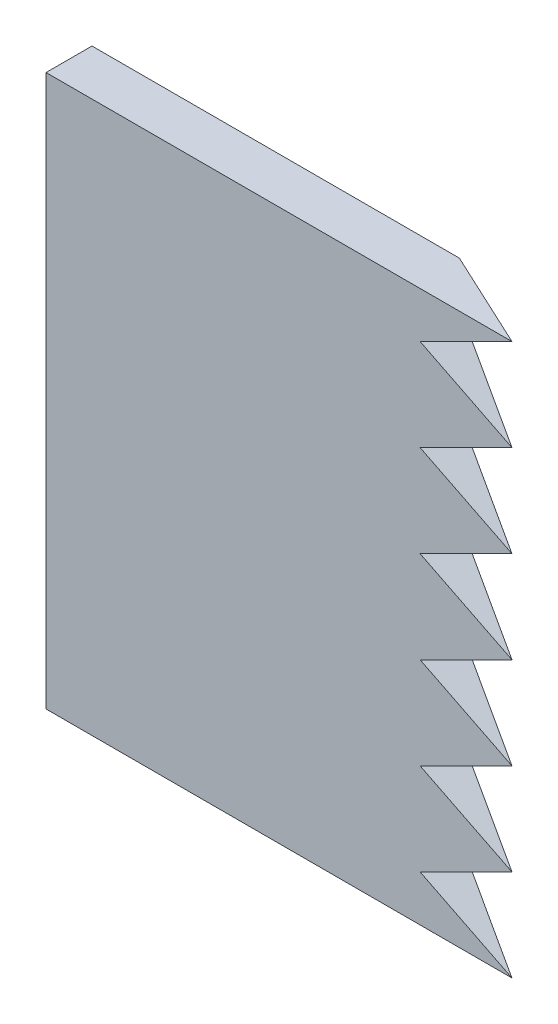
ISO-10303-21;
HEADER;
FILE_DESCRIPTION(('STEP AP214'),'2;1');
FILE_NAME('part.step','',(''),(''),'','','');
FILE_SCHEMA(('AUTOMOTIVE_DESIGN { 1 0 10303 214 1 1 1 1 }'));
ENDSEC;
DATA;
#1=APPLICATION_CONTEXT('core data for automotive mechanical design processes');
#2=APPLICATION_PROTOCOL_DEFINITION('international standard','automotive_design',2000,#1);
#3=PRODUCT_CONTEXT('',#1,'mechanical');
#4=PRODUCT('Part','Part','',(#3));
#5=PRODUCT_RELATED_PRODUCT_CATEGORY('part','',(#4));
#6=PRODUCT_DEFINITION_FORMATION('','',#4);
#7=PRODUCT_DEFINITION_CONTEXT('part definition',#1,'design');
#8=PRODUCT_DEFINITION('design','',#6,#7);
#9=PRODUCT_DEFINITION_SHAPE('','',#8);
#10=(LENGTH_UNIT() NAMED_UNIT(*) SI_UNIT(.MILLI.,.METRE.));
#11=(NAMED_UNIT(*) PLANE_ANGLE_UNIT() SI_UNIT($,.RADIAN.));
#12=(NAMED_UNIT(*) SI_UNIT($,.STERADIAN.) SOLID_ANGLE_UNIT());
#13=UNCERTAINTY_MEASURE_WITH_UNIT(LENGTH_MEASURE(1.E-05),#10,'distance_accuracy_value','');
#14=(GEOMETRIC_REPRESENTATION_CONTEXT(3) GLOBAL_UNCERTAINTY_ASSIGNED_CONTEXT((#13)) GLOBAL_UNIT_ASSIGNED_CONTEXT((#10,
#11,#12)) REPRESENTATION_CONTEXT('',''));
#15=CARTESIAN_POINT('',(0.,0.,0.));
#16=DIRECTION('',(0.,0.,1.));
#17=DIRECTION('',(1.,0.,0.));
#18=AXIS2_PLACEMENT_3D('',#15,#16,#17);
#19=CARTESIAN_POINT('',(0.,76.2,146.05));
#20=DIRECTION('',(1.,0.,0.));
#21=DIRECTION('',(0.,0.,-1.));
#22=AXIS2_PLACEMENT_3D('',#19,#20,#21);
#23=PLANE('',#22);
#24=DIRECTION('',(0.,0.,1.));
#25=VECTOR('',#24,1.);
#26=CARTESIAN_POINT('',(0.,0.,146.05));
#27=LINE('',#26,#25);
#28=CARTESIAN_POINT('',(0.,0.,139.7));
#29=VERTEX_POINT('',#28);
#30=CARTESIAN_POINT('',(0.,0.,146.05));
#31=VERTEX_POINT('',#30);
#32=EDGE_CURVE('E214',#29,#31,#27,.T.);
#33=ORIENTED_EDGE('',*,*,#32,.T.);
#34=DIRECTION('',(0.,-1.,0.));
#35=VECTOR('',#34,1.);
#36=CARTESIAN_POINT('',(0.,76.2,146.05));
#37=LINE('',#36,#35);
#38=CARTESIAN_POINT('',(0.,76.2,146.05));
#39=VERTEX_POINT('',#38);
#40=EDGE_CURVE('E239',#39,#31,#37,.T.);
#41=ORIENTED_EDGE('',*,*,#40,.F.);
#42=DIRECTION('',(0.,0.,1.));
#43=VECTOR('',#42,1.);
#44=CARTESIAN_POINT('',(0.,76.2,146.05));
#45=LINE('',#44,#43);
#46=CARTESIAN_POINT('',(0.,76.2,139.7));
#47=VERTEX_POINT('',#46);
#48=EDGE_CURVE('E215',#47,#39,#45,.T.);
#49=ORIENTED_EDGE('',*,*,#48,.F.);
#50=DIRECTION('',(0.,-1.,0.));
#51=VECTOR('',#50,1.);
#52=CARTESIAN_POINT('',(0.,76.2,139.7));
#53=LINE('',#52,#51);
#54=EDGE_CURVE('E225',#47,#29,#53,.T.);
#55=ORIENTED_EDGE('',*,*,#54,.T.);
#56=EDGE_LOOP('',(#33,#41,#49,#55));
#57=FACE_BOUND('',#56,.T.);
#58=ADVANCED_FACE('F52',(#57),#23,.F.);
#59=CARTESIAN_POINT('',(0.,76.2,146.05));
#60=DIRECTION('',(0.,0.,-1.));
#61=DIRECTION('',(-1.,0.,0.));
#62=AXIS2_PLACEMENT_3D('',#59,#60,#61);
#63=PLANE('',#62);
#64=DIRECTION('',(0.894427190999916,-0.447213595499958,0.));
#65=VECTOR('',#64,1.);
#66=CARTESIAN_POINT('',(38.2814046178566,76.5628092357131,146.05));
#67=LINE('',#66,#65);
#68=CARTESIAN_POINT('',(51.7070230892828,69.85,146.05));
#69=VERTEX_POINT('',#68);
#70=CARTESIAN_POINT('',(64.4070230892828,63.5,146.05));
#71=VERTEX_POINT('',#70);
#72=EDGE_CURVE('E146',#69,#71,#67,.T.);
#73=ORIENTED_EDGE('',*,*,#72,.F.);
#74=DIRECTION('',(-0.894427190999916,-0.447213595499958,0.));
#75=VECTOR('',#74,1.);
#76=CARTESIAN_POINT('',(-17.5985953821434,35.1971907642869,146.05));
#77=LINE('',#76,#75);
#78=CARTESIAN_POINT('',(64.4070230892828,76.2,146.05));
#79=VERTEX_POINT('',#78);
#80=EDGE_CURVE('E153',#79,#69,#77,.T.);
#81=ORIENTED_EDGE('',*,*,#80,.F.);
#82=DIRECTION('',(1.,0.,0.));
#83=VECTOR('',#82,1.);
#84=CARTESIAN_POINT('',(0.,76.2,146.05));
#85=LINE('',#84,#83);
#86=EDGE_CURVE('E218',#39,#79,#85,.T.);
#87=ORIENTED_EDGE('',*,*,#86,.F.);
#88=ORIENTED_EDGE('',*,*,#40,.T.);
#89=DIRECTION('',(1.,0.,0.));
#90=VECTOR('',#89,1.);
#91=CARTESIAN_POINT('',(0.,0.,146.05));
#92=LINE('',#91,#90);
#93=CARTESIAN_POINT('',(64.4070230892828,0.,146.05));
#94=VERTEX_POINT('',#93);
#95=EDGE_CURVE('E228',#31,#94,#92,.T.);
#96=ORIENTED_EDGE('',*,*,#95,.T.);
#97=DIRECTION('',(0.894427190999916,-0.447213595499958,0.));
#98=VECTOR('',#97,1.);
#99=CARTESIAN_POINT('',(12.8814046178567,25.7628092357134,146.05));
#100=LINE('',#99,#98);
#101=CARTESIAN_POINT('',(51.7070230892835,6.35000000000001,146.05));
#102=VERTEX_POINT('',#101);
#103=EDGE_CURVE('E193',#102,#94,#100,.T.);
#104=ORIENTED_EDGE('',*,*,#103,.F.);
#105=DIRECTION('',(-0.894427190999916,-0.447213595499958,0.));
#106=VECTOR('',#105,1.);
#107=CARTESIAN_POINT('',(7.80140461785668,-15.6028092357134,146.05));
#108=LINE('',#107,#106);
#109=CARTESIAN_POINT('',(64.4070230892828,12.7000000000003,146.05));
#110=VERTEX_POINT('',#109);
#111=EDGE_CURVE('E190',#110,#102,#108,.T.);
#112=ORIENTED_EDGE('',*,*,#111,.F.);
#113=DIRECTION('',(0.894427190999916,-0.447213595499959,0.));
#114=VECTOR('',#113,1.);
#115=CARTESIAN_POINT('',(17.9614046178567,35.9228092357134,146.05));
#116=LINE('',#115,#114);
#117=CARTESIAN_POINT('',(51.7070230892834,19.05,146.05));
#118=VERTEX_POINT('',#117);
#119=EDGE_CURVE('E181',#118,#110,#116,.T.);
#120=ORIENTED_EDGE('',*,*,#119,.F.);
#121=DIRECTION('',(-0.894427190999916,-0.447213595499958,0.));
#122=VECTOR('',#121,1.);
#123=CARTESIAN_POINT('',(2.72140461785666,-5.44280923571333,146.05));
#124=LINE('',#123,#122);
#125=CARTESIAN_POINT('',(64.4070230892828,25.4000000000002,146.05));
#126=VERTEX_POINT('',#125);
#127=EDGE_CURVE('E179',#126,#118,#124,.T.);
#128=ORIENTED_EDGE('',*,*,#127,.F.);
#129=DIRECTION('',(0.894427190999916,-0.447213595499958,0.));
#130=VECTOR('',#129,1.);
#131=CARTESIAN_POINT('',(23.0414046178567,46.0828092357133,146.05));
#132=LINE('',#131,#130);
#133=CARTESIAN_POINT('',(51.7070230892832,31.75,146.05));
#134=VERTEX_POINT('',#133);
#135=EDGE_CURVE('E202',#134,#126,#132,.T.);
#136=ORIENTED_EDGE('',*,*,#135,.F.);
#137=DIRECTION('',(-0.894427190999916,-0.447213595499958,0.));
#138=VECTOR('',#137,1.);
#139=CARTESIAN_POINT('',(-2.35859538214337,4.71719076428674,146.05));
#140=LINE('',#139,#138);
#141=CARTESIAN_POINT('',(64.4070230892828,38.1000000000001,146.05));
#142=VERTEX_POINT('',#141);
#143=EDGE_CURVE('E199',#142,#134,#140,.T.);
#144=ORIENTED_EDGE('',*,*,#143,.F.);
#145=DIRECTION('',(0.894427190999916,-0.447213595499958,0.));
#146=VECTOR('',#145,1.);
#147=CARTESIAN_POINT('',(28.1214046178567,56.2428092357132,146.05));
#148=LINE('',#147,#146);
#149=CARTESIAN_POINT('',(51.7070230892831,44.45,146.05));
#150=VERTEX_POINT('',#149);
#151=EDGE_CURVE('E170',#150,#142,#148,.T.);
#152=ORIENTED_EDGE('',*,*,#151,.F.);
#153=DIRECTION('',(-0.894427190999916,-0.447213595499958,0.));
#154=VECTOR('',#153,1.);
#155=CARTESIAN_POINT('',(-7.43859538214339,14.8771907642868,146.05));
#156=LINE('',#155,#154);
#157=CARTESIAN_POINT('',(64.4070230892828,50.8000000000001,146.05));
#158=VERTEX_POINT('',#157);
#159=EDGE_CURVE('E168',#158,#150,#156,.T.);
#160=ORIENTED_EDGE('',*,*,#159,.F.);
#161=DIRECTION('',(0.894427190999916,-0.447213595499958,0.));
#162=VECTOR('',#161,1.);
#163=CARTESIAN_POINT('',(33.2014046178566,66.4028092357132,146.05));
#164=LINE('',#163,#162);
#165=CARTESIAN_POINT('',(51.707023089283,57.15,146.05));
#166=VERTEX_POINT('',#165);
#167=EDGE_CURVE('E208',#166,#158,#164,.T.);
#168=ORIENTED_EDGE('',*,*,#167,.F.);
#169=DIRECTION('',(-0.894427190999916,-0.447213595499957,0.));
#170=VECTOR('',#169,1.);
#171=CARTESIAN_POINT('',(-12.5185953821434,25.0371907642869,146.05));
#172=LINE('',#171,#170);
#173=EDGE_CURVE('E163',#71,#166,#172,.T.);
#174=ORIENTED_EDGE('',*,*,#173,.F.);
#175=EDGE_LOOP('',(#73,#81,#87,#88,#96,#104,#112,#120,#128,#136,#144,#152,#160,#168,#174));
#176=FACE_BOUND('',#175,.T.);
#177=ADVANCED_FACE('F160',(#176),#63,.F.);
#178=CARTESIAN_POINT('',(64.4070230892828,76.2,146.05));
#179=DIRECTION('',(-0.422618261740692,0.,0.906307787036653));
#180=DIRECTION('',(0.906307787036654,0.,0.422618261740692));
#181=AXIS2_PLACEMENT_3D('',#178,#179,#180);
#182=PLANE('',#181);
#183=DIRECTION('',(-0.906307787036653,0.,-0.422618261740692));
#184=VECTOR('',#183,1.);
#185=CARTESIAN_POINT('',(64.4070230892828,76.2,146.05));
#186=LINE('',#185,#184);
#187=CARTESIAN_POINT('',(50.7894041440469,76.2,139.7));
#188=VERTEX_POINT('',#187);
#189=EDGE_CURVE('E221',#79,#188,#186,.T.);
#190=ORIENTED_EDGE('',*,*,#189,.F.);
#191=DIRECTION('',(-0.825504422749244,-0.412752211374621,-0.384939034168785));
#192=VECTOR('',#191,1.);
#193=CARTESIAN_POINT('',(64.4070230892828,76.2,146.05));
#194=LINE('',#193,#192);
#195=CARTESIAN_POINT('',(51.7070230892828,69.85,140.127892741432));
#196=VERTEX_POINT('',#195);
#197=EDGE_CURVE('E155',#79,#196,#194,.T.);
#198=ORIENTED_EDGE('',*,*,#197,.T.);
#199=DIRECTION('',(0.825504422749243,-0.412752211374622,0.384939034168785));
#200=VECTOR('',#199,1.);
#201=CARTESIAN_POINT('',(60.079767634219,65.6636277275319,144.032167642511));
#202=LINE('',#201,#200);
#203=EDGE_CURVE('E148',#196,#71,#202,.T.);
#204=ORIENTED_EDGE('',*,*,#203,.T.);
#205=DIRECTION('',(-0.825504422749244,-0.412752211374621,-0.384939034168785));
#206=VECTOR('',#205,1.);
#207=CARTESIAN_POINT('',(68.7342785443467,65.6636277275319,148.067832357489));
#208=LINE('',#207,#206);
#209=CARTESIAN_POINT('',(51.707023089283,57.15,140.127892741432));
#210=VERTEX_POINT('',#209);
#211=EDGE_CURVE('E242',#71,#210,#208,.T.);
#212=ORIENTED_EDGE('',*,*,#211,.T.);
#213=DIRECTION('',(0.825504422749244,-0.412752211374622,0.384939034168785));
#214=VECTOR('',#213,1.);
#215=CARTESIAN_POINT('',(55.7525121791551,55.127255455064,142.014335285022));
#216=LINE('',#215,#214);
#217=EDGE_CURVE('E245',#210,#158,#216,.T.);
#218=ORIENTED_EDGE('',*,*,#217,.T.);
#219=DIRECTION('',(-0.825504422749244,-0.412752211374621,-0.384939034168785));
#220=VECTOR('',#219,1.);
#221=CARTESIAN_POINT('',(73.0615339994106,55.1272554550638,150.085664714978));
#222=LINE('',#221,#220);
#223=CARTESIAN_POINT('',(51.7070230892831,44.45,140.127892741432));
#224=VERTEX_POINT('',#223);
#225=EDGE_CURVE('E176',#158,#224,#222,.T.);
#226=ORIENTED_EDGE('',*,*,#225,.T.);
#227=DIRECTION('',(0.825504422749243,-0.412752211374622,0.384939034168785));
#228=VECTOR('',#227,1.);
#229=CARTESIAN_POINT('',(51.4252567240913,44.5908831825959,139.996502927532));
#230=LINE('',#229,#228);
#231=EDGE_CURVE('E173',#224,#142,#230,.T.);
#232=ORIENTED_EDGE('',*,*,#231,.T.);
#233=DIRECTION('',(-0.825504422749244,-0.412752211374621,-0.384939034168785));
#234=VECTOR('',#233,1.);
#235=CARTESIAN_POINT('',(77.3887894544745,44.5908831825956,152.103497072468));
#236=LINE('',#235,#234);
#237=CARTESIAN_POINT('',(51.7070230892832,31.75,140.127892741432));
#238=VERTEX_POINT('',#237);
#239=EDGE_CURVE('E248',#142,#238,#236,.T.);
#240=ORIENTED_EDGE('',*,*,#239,.T.);
#241=DIRECTION('',(0.825504422749243,-0.412752211374622,0.384939034168785));
#242=VECTOR('',#241,1.);
#243=CARTESIAN_POINT('',(47.0980012690274,34.0545109101279,137.978670570043));
#244=LINE('',#243,#242);
#245=EDGE_CURVE('E59',#238,#126,#244,.T.);
#246=ORIENTED_EDGE('',*,*,#245,.T.);
#247=DIRECTION('',(-0.825504422749244,-0.412752211374622,-0.384939034168785));
#248=VECTOR('',#247,1.);
#249=CARTESIAN_POINT('',(81.7160449095384,34.0545109101275,154.121329429957));
#250=LINE('',#249,#248);
#251=CARTESIAN_POINT('',(51.7070230892834,19.05,140.127892741432));
#252=VERTEX_POINT('',#251);
#253=EDGE_CURVE('E187',#126,#252,#250,.T.);
#254=ORIENTED_EDGE('',*,*,#253,.T.);
#255=DIRECTION('',(0.825504422749243,-0.412752211374622,0.384939034168785));
#256=VECTOR('',#255,1.);
#257=CARTESIAN_POINT('',(42.7707458139636,23.5181386376599,135.960838212554));
#258=LINE('',#257,#256);
#259=EDGE_CURVE('E184',#252,#110,#258,.T.);
#260=ORIENTED_EDGE('',*,*,#259,.T.);
#261=DIRECTION('',(-0.825504422749244,-0.412752211374621,-0.384939034168785));
#262=VECTOR('',#261,1.);
#263=CARTESIAN_POINT('',(86.0433003646023,23.5181386376594,156.139161787446));
#264=LINE('',#263,#262);
#265=CARTESIAN_POINT('',(51.7070230892835,6.35,140.127892741432));
#266=VERTEX_POINT('',#265);
#267=EDGE_CURVE('E12',#110,#266,#264,.T.);
#268=ORIENTED_EDGE('',*,*,#267,.T.);
#269=DIRECTION('',(0.825504422749243,-0.412752211374622,0.384939034168785));
#270=VECTOR('',#269,1.);
#271=CARTESIAN_POINT('',(38.4434903588997,12.9817663651919,133.943005855065));
#272=LINE('',#271,#270);
#273=EDGE_CURVE('E198',#266,#94,#272,.T.);
#274=ORIENTED_EDGE('',*,*,#273,.T.);
#275=DIRECTION('',(-0.906307787036653,0.,-0.422618261740692));
#276=VECTOR('',#275,1.);
#277=CARTESIAN_POINT('',(64.4070230892828,0.,146.05));
#278=LINE('',#277,#276);
#279=CARTESIAN_POINT('',(50.7894041440469,0.,139.7));
#280=VERTEX_POINT('',#279);
#281=EDGE_CURVE('E231',#94,#280,#278,.T.);
#282=ORIENTED_EDGE('',*,*,#281,.T.);
#283=DIRECTION('',(0.,-1.,0.));
#284=VECTOR('',#283,1.);
#285=CARTESIAN_POINT('',(50.7894041440469,76.2,139.7));
#286=LINE('',#285,#284);
#287=EDGE_CURVE('E236',#188,#280,#286,.T.);
#288=ORIENTED_EDGE('',*,*,#287,.F.);
#289=EDGE_LOOP('',(#190,#198,#204,#212,#218,#226,#232,#240,#246,#254,#260,#268,#274,#282,#288));
#290=FACE_BOUND('',#289,.T.);
#291=ADVANCED_FACE('F254',(#290),#182,.F.);
#292=CARTESIAN_POINT('',(0.,76.2,139.7));
#293=DIRECTION('',(0.,0.,1.));
#294=DIRECTION('',(1.,0.,0.));
#295=AXIS2_PLACEMENT_3D('',#292,#293,#294);
#296=PLANE('',#295);
#297=DIRECTION('',(-1.,0.,0.));
#298=VECTOR('',#297,1.);
#299=CARTESIAN_POINT('',(0.,0.,139.7));
#300=LINE('',#299,#298);
#301=EDGE_CURVE('E219',#280,#29,#300,.T.);
#302=ORIENTED_EDGE('',*,*,#301,.T.);
#303=ORIENTED_EDGE('',*,*,#54,.F.);
#304=DIRECTION('',(-1.,0.,0.));
#305=VECTOR('',#304,1.);
#306=CARTESIAN_POINT('',(0.,76.2,139.7));
#307=LINE('',#306,#305);
#308=EDGE_CURVE('E223',#188,#47,#307,.T.);
#309=ORIENTED_EDGE('',*,*,#308,.F.);
#310=ORIENTED_EDGE('',*,*,#287,.T.);
#311=EDGE_LOOP('',(#302,#303,#309,#310));
#312=FACE_BOUND('',#311,.T.);
#313=ADVANCED_FACE('F298',(#312),#296,.F.);
#314=CARTESIAN_POINT('',(0.,76.2,0.));
#315=DIRECTION('',(0.,-1.,0.));
#316=DIRECTION('',(0.,0.,-1.));
#317=AXIS2_PLACEMENT_3D('',#314,#315,#316);
#318=PLANE('',#317);
#319=ORIENTED_EDGE('',*,*,#48,.T.);
#320=ORIENTED_EDGE('',*,*,#86,.T.);
#321=ORIENTED_EDGE('',*,*,#189,.T.);
#322=ORIENTED_EDGE('',*,*,#308,.T.);
#323=EDGE_LOOP('',(#319,#320,#321,#322));
#324=FACE_BOUND('',#323,.T.);
#325=ADVANCED_FACE('F294',(#324),#318,.F.);
#326=CARTESIAN_POINT('',(0.,0.,0.));
#327=DIRECTION('',(0.,-1.,0.));
#328=DIRECTION('',(0.,0.,-1.));
#329=AXIS2_PLACEMENT_3D('',#326,#327,#328);
#330=PLANE('',#329);
#331=ORIENTED_EDGE('',*,*,#32,.F.);
#332=ORIENTED_EDGE('',*,*,#301,.F.);
#333=ORIENTED_EDGE('',*,*,#281,.F.);
#334=ORIENTED_EDGE('',*,*,#95,.F.);
#335=EDGE_LOOP('',(#331,#332,#333,#334));
#336=FACE_BOUND('',#335,.T.);
#337=ADVANCED_FACE('F290',(#336),#330,.T.);
#338=CARTESIAN_POINT('',(33.2014046178566,66.4028092357132,139.7));
#339=DIRECTION('',(-0.447213595499958,-0.894427190999916,0.));
#340=DIRECTION('',(0.894427190999916,-0.447213595499958,0.));
#341=AXIS2_PLACEMENT_3D('',#338,#339,#340);
#342=PLANE('',#341);
#343=DIRECTION('',(0.,0.,1.));
#344=VECTOR('',#343,1.);
#345=CARTESIAN_POINT('',(51.707023089283,57.15,139.7));
#346=LINE('',#345,#344);
#347=EDGE_CURVE('E203',#210,#166,#346,.T.);
#348=ORIENTED_EDGE('',*,*,#347,.T.);
#349=ORIENTED_EDGE('',*,*,#167,.T.);
#350=ORIENTED_EDGE('',*,*,#217,.F.);
#351=EDGE_LOOP('',(#348,#349,#350));
#352=FACE_BOUND('',#351,.T.);
#353=ADVANCED_FACE('F314',(#352),#342,.F.);
#354=CARTESIAN_POINT('',(-12.5185953821434,25.0371907642869,139.7));
#355=DIRECTION('',(-0.447213595499957,0.894427190999916,0.));
#356=DIRECTION('',(-0.894427190999916,-0.447213595499957,0.));
#357=AXIS2_PLACEMENT_3D('',#354,#355,#356);
#358=PLANE('',#357);
#359=ORIENTED_EDGE('',*,*,#173,.T.);
#360=ORIENTED_EDGE('',*,*,#347,.F.);
#361=ORIENTED_EDGE('',*,*,#211,.F.);
#362=EDGE_LOOP('',(#359,#360,#361));
#363=FACE_BOUND('',#362,.T.);
#364=ADVANCED_FACE('F312',(#363),#358,.F.);
#365=CARTESIAN_POINT('',(23.0414046178567,46.0828092357133,139.7));
#366=DIRECTION('',(-0.447213595499958,-0.894427190999916,0.));
#367=DIRECTION('',(0.894427190999916,-0.447213595499958,0.));
#368=AXIS2_PLACEMENT_3D('',#365,#366,#367);
#369=PLANE('',#368);
#370=DIRECTION('',(0.,0.,1.));
#371=VECTOR('',#370,1.);
#372=CARTESIAN_POINT('',(51.7070230892832,31.75,139.7));
#373=LINE('',#372,#371);
#374=EDGE_CURVE('E194',#238,#134,#373,.T.);
#375=ORIENTED_EDGE('',*,*,#374,.T.);
#376=ORIENTED_EDGE('',*,*,#135,.T.);
#377=ORIENTED_EDGE('',*,*,#245,.F.);
#378=EDGE_LOOP('',(#375,#376,#377));
#379=FACE_BOUND('',#378,.T.);
#380=ADVANCED_FACE('F257',(#379),#369,.F.);
#381=CARTESIAN_POINT('',(-2.35859538214337,4.71719076428674,139.7));
#382=DIRECTION('',(-0.447213595499958,0.894427190999916,0.));
#383=DIRECTION('',(-0.894427190999916,-0.447213595499958,0.));
#384=AXIS2_PLACEMENT_3D('',#381,#382,#383);
#385=PLANE('',#384);
#386=ORIENTED_EDGE('',*,*,#143,.T.);
#387=ORIENTED_EDGE('',*,*,#374,.F.);
#388=ORIENTED_EDGE('',*,*,#239,.F.);
#389=EDGE_LOOP('',(#386,#387,#388));
#390=FACE_BOUND('',#389,.T.);
#391=ADVANCED_FACE('F303',(#390),#385,.F.);
#392=CARTESIAN_POINT('',(7.80140461785668,-15.6028092357134,139.7));
#393=DIRECTION('',(-0.447213595499958,0.894427190999916,0.));
#394=DIRECTION('',(-0.894427190999916,-0.447213595499958,0.));
#395=AXIS2_PLACEMENT_3D('',#392,#393,#394);
#396=PLANE('',#395);
#397=ORIENTED_EDGE('',*,*,#111,.T.);
#398=DIRECTION('',(0.,0.,1.));
#399=VECTOR('',#398,1.);
#400=CARTESIAN_POINT('',(51.7070230892835,6.35000000000001,139.7));
#401=LINE('',#400,#399);
#402=EDGE_CURVE('E196',#266,#102,#401,.T.);
#403=ORIENTED_EDGE('',*,*,#402,.F.);
#404=ORIENTED_EDGE('',*,*,#267,.F.);
#405=EDGE_LOOP('',(#397,#403,#404));
#406=FACE_BOUND('',#405,.T.);
#407=ADVANCED_FACE('F276',(#406),#396,.F.);
#408=CARTESIAN_POINT('',(12.8814046178567,25.7628092357134,139.7));
#409=DIRECTION('',(-0.447213595499958,-0.894427190999916,0.));
#410=DIRECTION('',(0.894427190999916,-0.447213595499958,0.));
#411=AXIS2_PLACEMENT_3D('',#408,#409,#410);
#412=PLANE('',#411);
#413=ORIENTED_EDGE('',*,*,#402,.T.);
#414=ORIENTED_EDGE('',*,*,#103,.T.);
#415=ORIENTED_EDGE('',*,*,#273,.F.);
#416=EDGE_LOOP('',(#413,#414,#415));
#417=FACE_BOUND('',#416,.T.);
#418=ADVANCED_FACE('F267',(#417),#412,.F.);
#419=CARTESIAN_POINT('',(2.72140461785666,-5.44280923571333,139.7));
#420=DIRECTION('',(-0.447213595499958,0.894427190999916,0.));
#421=DIRECTION('',(-0.894427190999916,-0.447213595499958,0.));
#422=AXIS2_PLACEMENT_3D('',#419,#420,#421);
#423=PLANE('',#422);
#424=ORIENTED_EDGE('',*,*,#127,.T.);
#425=DIRECTION('',(0.,0.,1.));
#426=VECTOR('',#425,1.);
#427=CARTESIAN_POINT('',(51.7070230892834,19.05,139.7));
#428=LINE('',#427,#426);
#429=EDGE_CURVE('E74',#252,#118,#428,.T.);
#430=ORIENTED_EDGE('',*,*,#429,.F.);
#431=ORIENTED_EDGE('',*,*,#253,.F.);
#432=EDGE_LOOP('',(#424,#430,#431));
#433=FACE_BOUND('',#432,.T.);
#434=ADVANCED_FACE('F264',(#433),#423,.F.);
#435=CARTESIAN_POINT('',(17.9614046178567,35.9228092357134,139.7));
#436=DIRECTION('',(-0.447213595499959,-0.894427190999916,0.));
#437=DIRECTION('',(0.894427190999916,-0.447213595499959,0.));
#438=AXIS2_PLACEMENT_3D('',#435,#436,#437);
#439=PLANE('',#438);
#440=ORIENTED_EDGE('',*,*,#429,.T.);
#441=ORIENTED_EDGE('',*,*,#119,.T.);
#442=ORIENTED_EDGE('',*,*,#259,.F.);
#443=EDGE_LOOP('',(#440,#441,#442));
#444=FACE_BOUND('',#443,.T.);
#445=ADVANCED_FACE('F266',(#444),#439,.F.);
#446=CARTESIAN_POINT('',(-7.43859538214339,14.8771907642868,139.7));
#447=DIRECTION('',(-0.447213595499958,0.894427190999916,0.));
#448=DIRECTION('',(-0.894427190999916,-0.447213595499958,0.));
#449=AXIS2_PLACEMENT_3D('',#446,#447,#448);
#450=PLANE('',#449);
#451=ORIENTED_EDGE('',*,*,#159,.T.);
#452=DIRECTION('',(0.,0.,1.));
#453=VECTOR('',#452,1.);
#454=CARTESIAN_POINT('',(51.7070230892831,44.45,139.7));
#455=LINE('',#454,#453);
#456=EDGE_CURVE('E66',#224,#150,#455,.T.);
#457=ORIENTED_EDGE('',*,*,#456,.F.);
#458=ORIENTED_EDGE('',*,*,#225,.F.);
#459=EDGE_LOOP('',(#451,#457,#458));
#460=FACE_BOUND('',#459,.T.);
#461=ADVANCED_FACE('F273',(#460),#450,.F.);
#462=CARTESIAN_POINT('',(28.1214046178567,56.2428092357132,139.7));
#463=DIRECTION('',(-0.447213595499958,-0.894427190999916,0.));
#464=DIRECTION('',(0.894427190999916,-0.447213595499958,0.));
#465=AXIS2_PLACEMENT_3D('',#462,#463,#464);
#466=PLANE('',#465);
#467=ORIENTED_EDGE('',*,*,#456,.T.);
#468=ORIENTED_EDGE('',*,*,#151,.T.);
#469=ORIENTED_EDGE('',*,*,#231,.F.);
#470=EDGE_LOOP('',(#467,#468,#469));
#471=FACE_BOUND('',#470,.T.);
#472=ADVANCED_FACE('F389',(#471),#466,.F.);
#473=CARTESIAN_POINT('',(-17.5985953821434,35.1971907642869,139.7));
#474=DIRECTION('',(-0.447213595499958,0.894427190999916,0.));
#475=DIRECTION('',(-0.894427190999916,-0.447213595499958,0.));
#476=AXIS2_PLACEMENT_3D('',#473,#474,#475);
#477=PLANE('',#476);
#478=ORIENTED_EDGE('',*,*,#80,.T.);
#479=DIRECTION('',(0.,0.,1.));
#480=VECTOR('',#479,1.);
#481=CARTESIAN_POINT('',(51.7070230892828,69.85,139.7));
#482=LINE('',#481,#480);
#483=EDGE_CURVE('E142',#196,#69,#482,.T.);
#484=ORIENTED_EDGE('',*,*,#483,.F.);
#485=ORIENTED_EDGE('',*,*,#197,.F.);
#486=EDGE_LOOP('',(#478,#484,#485));
#487=FACE_BOUND('',#486,.T.);
#488=ADVANCED_FACE('F154',(#487),#477,.F.);
#489=CARTESIAN_POINT('',(38.2814046178566,76.5628092357131,139.7));
#490=DIRECTION('',(-0.447213595499958,-0.894427190999916,0.));
#491=DIRECTION('',(0.894427190999916,-0.447213595499958,0.));
#492=AXIS2_PLACEMENT_3D('',#489,#490,#491);
#493=PLANE('',#492);
#494=ORIENTED_EDGE('',*,*,#483,.T.);
#495=ORIENTED_EDGE('',*,*,#72,.T.);
#496=ORIENTED_EDGE('',*,*,#203,.F.);
#497=EDGE_LOOP('',(#494,#495,#496));
#498=FACE_BOUND('',#497,.T.);
#499=ADVANCED_FACE('F144',(#498),#493,.F.);
#500=CLOSED_SHELL('',(#58,#177,#291,#313,#325,#337,#353,#364,#380,#391,#407,#418,#434,#445,#461,
#472,#488,#499));
#501=MANIFOLD_SOLID_BREP('B2',#500);
#502=ADVANCED_BREP_SHAPE_REPRESENTATION('',(#18,#501),#14);
#503=SHAPE_DEFINITION_REPRESENTATION(#9,#502);
ENDSEC;
END-ISO-10303-21;
